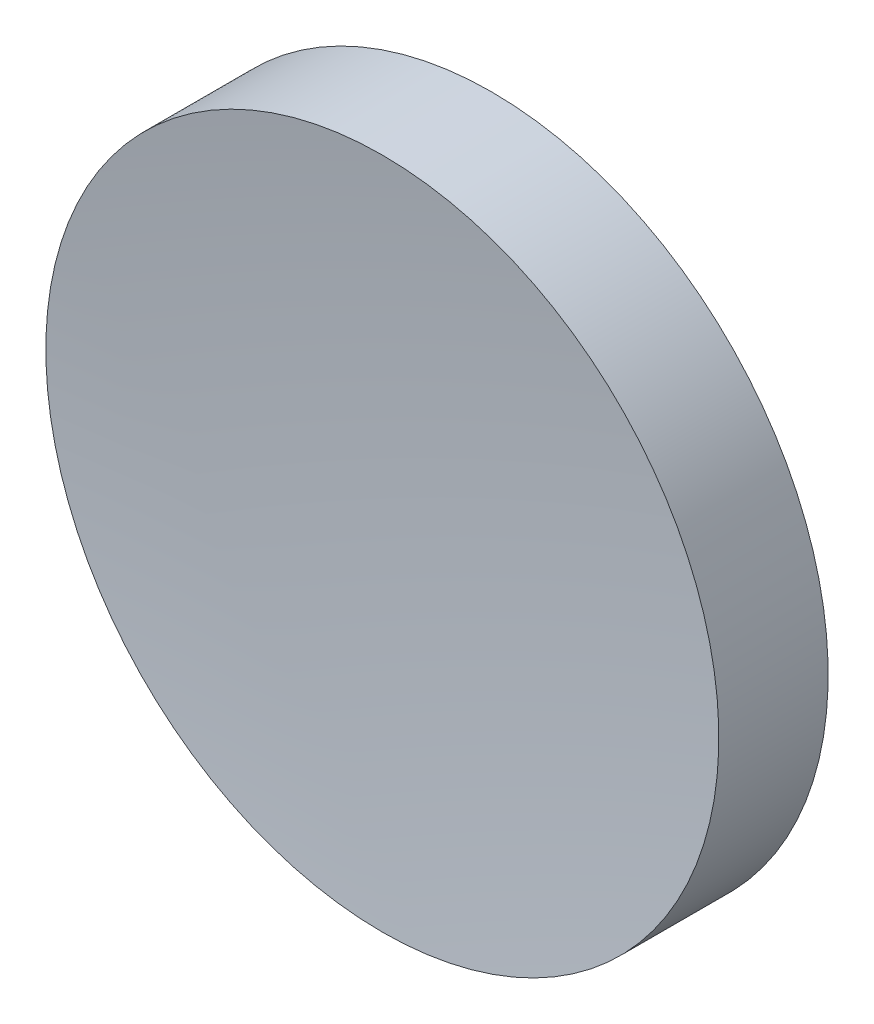
ISO-10303-21;
HEADER;
FILE_DESCRIPTION(('STEP AP214'),'2;1');
FILE_NAME('part.step','',(''),(''),'','','');
FILE_SCHEMA(('AUTOMOTIVE_DESIGN { 1 0 10303 214 1 1 1 1 }'));
ENDSEC;
DATA;
#1=APPLICATION_CONTEXT('core data for automotive mechanical design processes');
#2=APPLICATION_PROTOCOL_DEFINITION('international standard','automotive_design',2000,#1);
#3=PRODUCT_CONTEXT('',#1,'mechanical');
#4=PRODUCT('Part','Part','',(#3));
#5=PRODUCT_RELATED_PRODUCT_CATEGORY('part','',(#4));
#6=PRODUCT_DEFINITION_FORMATION('','',#4);
#7=PRODUCT_DEFINITION_CONTEXT('part definition',#1,'design');
#8=PRODUCT_DEFINITION('design','',#6,#7);
#9=PRODUCT_DEFINITION_SHAPE('','',#8);
#10=(LENGTH_UNIT() NAMED_UNIT(*) SI_UNIT(.MILLI.,.METRE.));
#11=(NAMED_UNIT(*) PLANE_ANGLE_UNIT() SI_UNIT($,.RADIAN.));
#12=(NAMED_UNIT(*) SI_UNIT($,.STERADIAN.) SOLID_ANGLE_UNIT());
#13=UNCERTAINTY_MEASURE_WITH_UNIT(LENGTH_MEASURE(1.E-05),#10,'distance_accuracy_value','');
#14=(GEOMETRIC_REPRESENTATION_CONTEXT(3) GLOBAL_UNCERTAINTY_ASSIGNED_CONTEXT((#13)) GLOBAL_UNIT_ASSIGNED_CONTEXT((#10,
#11,#12)) REPRESENTATION_CONTEXT('',''));
#15=CARTESIAN_POINT('',(0.,0.,0.));
#16=DIRECTION('',(0.,0.,1.));
#17=DIRECTION('',(1.,0.,0.));
#18=AXIS2_PLACEMENT_3D('',#15,#16,#17);
#19=CARTESIAN_POINT('',(0.,0.,120.977));
#20=DIRECTION('',(0.,0.,1.));
#21=DIRECTION('',(0.,1.,0.));
#22=AXIS2_PLACEMENT_3D('',#19,#20,#21);
#23=SPHERICAL_SURFACE('',#22,118.977);
#24=CARTESIAN_POINT('',(0.,0.,2.67976195531866));
#25=DIRECTION('',(0.,0.,1.));
#26=DIRECTION('',(0.,-1.,0.));
#27=AXIS2_PLACEMENT_3D('',#24,#25,#26);
#28=CIRCLE('',#27,12.7);
#29=CARTESIAN_POINT('',(0.,-12.7,2.67976195531866));
#30=VERTEX_POINT('',#29);
#31=EDGE_CURVE('E36',#30,#30,#28,.T.);
#32=ORIENTED_EDGE('',*,*,#31,.T.);
#33=EDGE_LOOP('',(#32));
#34=FACE_BOUND('',#33,.T.);
#35=ADVANCED_FACE('F30',(#34),#23,.F.);
#36=CARTESIAN_POINT('',(0.,0.,144.097));
#37=DIRECTION('',(0.,0.,1.));
#38=DIRECTION('',(0.,-1.,0.));
#39=AXIS2_PLACEMENT_3D('',#36,#37,#38);
#40=SPHERICAL_SURFACE('',#39,146.097);
#41=CARTESIAN_POINT('',(0.,0.,-1.44695696489772));
#42=DIRECTION('',(0.,0.,1.));
#43=DIRECTION('',(0.,-1.,0.));
#44=AXIS2_PLACEMENT_3D('',#41,#42,#43);
#45=CIRCLE('',#44,12.7);
#46=CARTESIAN_POINT('',(0.,-12.7,-1.44695696489772));
#47=VERTEX_POINT('',#46);
#48=EDGE_CURVE('E10',#47,#47,#45,.T.);
#49=ORIENTED_EDGE('',*,*,#48,.F.);
#50=EDGE_LOOP('',(#49));
#51=FACE_BOUND('',#50,.T.);
#52=ADVANCED_FACE('F45',(#51),#40,.T.);
#53=CARTESIAN_POINT('',(0.,0.,2.));
#54=DIRECTION('',(0.,0.,1.));
#55=DIRECTION('',(0.,-1.,0.));
#56=AXIS2_PLACEMENT_3D('',#53,#54,#55);
#57=CYLINDRICAL_SURFACE('',#56,12.7);
#58=ORIENTED_EDGE('',*,*,#31,.F.);
#59=EDGE_LOOP('',(#58));
#60=FACE_BOUND('',#59,.T.);
#61=ORIENTED_EDGE('',*,*,#48,.T.);
#62=EDGE_LOOP('',(#61));
#63=FACE_BOUND('',#62,.T.);
#64=ADVANCED_FACE('F43',(#60,#63),#57,.T.);
#65=CLOSED_SHELL('',(#35,#52,#64));
#66=MANIFOLD_SOLID_BREP('B2',#65);
#67=ADVANCED_BREP_SHAPE_REPRESENTATION('',(#18,#66),#14);
#68=SHAPE_DEFINITION_REPRESENTATION(#9,#67);
ENDSEC;
END-ISO-10303-21;
